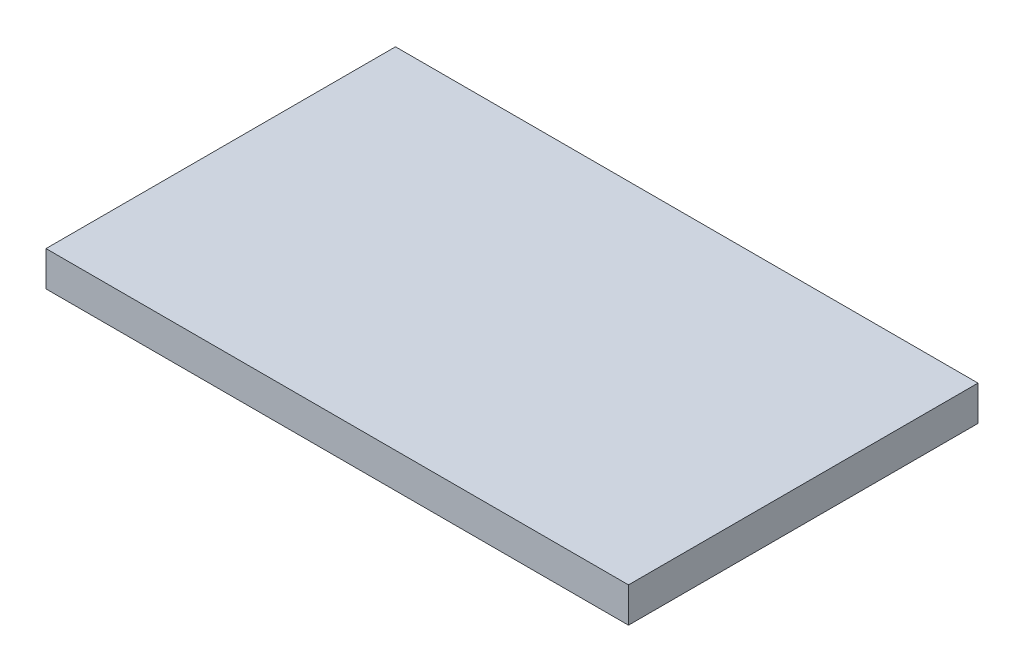
ISO-10303-21;
HEADER;
FILE_DESCRIPTION(('STEP AP214'),'2;1');
FILE_NAME('part.step','',(''),(''),'','','');
FILE_SCHEMA(('AUTOMOTIVE_DESIGN { 1 0 10303 214 1 1 1 1 }'));
ENDSEC;
DATA;
#1=APPLICATION_CONTEXT('core data for automotive mechanical design processes');
#2=APPLICATION_PROTOCOL_DEFINITION('international standard','automotive_design',2000,#1);
#3=PRODUCT_CONTEXT('',#1,'mechanical');
#4=PRODUCT('Part','Part','',(#3));
#5=PRODUCT_RELATED_PRODUCT_CATEGORY('part','',(#4));
#6=PRODUCT_DEFINITION_FORMATION('','',#4);
#7=PRODUCT_DEFINITION_CONTEXT('part definition',#1,'design');
#8=PRODUCT_DEFINITION('design','',#6,#7);
#9=PRODUCT_DEFINITION_SHAPE('','',#8);
#10=(LENGTH_UNIT() NAMED_UNIT(*) SI_UNIT(.MILLI.,.METRE.));
#11=(NAMED_UNIT(*) PLANE_ANGLE_UNIT() SI_UNIT($,.RADIAN.));
#12=(NAMED_UNIT(*) SI_UNIT($,.STERADIAN.) SOLID_ANGLE_UNIT());
#13=UNCERTAINTY_MEASURE_WITH_UNIT(LENGTH_MEASURE(1.E-05),#10,'distance_accuracy_value','');
#14=(GEOMETRIC_REPRESENTATION_CONTEXT(3) GLOBAL_UNCERTAINTY_ASSIGNED_CONTEXT((#13)) GLOBAL_UNIT_ASSIGNED_CONTEXT((#10,
#11,#12)) REPRESENTATION_CONTEXT('',''));
#15=CARTESIAN_POINT('',(0.,0.,0.));
#16=DIRECTION('',(0.,0.,1.));
#17=DIRECTION('',(1.,0.,0.));
#18=AXIS2_PLACEMENT_3D('',#15,#16,#17);
#19=CARTESIAN_POINT('',(0.,1.5,0.));
#20=DIRECTION('',(1.,0.,0.));
#21=DIRECTION('',(0.,0.,-1.));
#22=AXIS2_PLACEMENT_3D('',#19,#20,#21);
#23=PLANE('',#22);
#24=DIRECTION('',(0.,0.,1.));
#25=VECTOR('',#24,1.);
#26=CARTESIAN_POINT('',(0.,0.,0.));
#27=LINE('',#26,#25);
#28=CARTESIAN_POINT('',(0.,0.,-15.));
#29=VERTEX_POINT('',#28);
#30=CARTESIAN_POINT('',(0.,0.,0.));
#31=VERTEX_POINT('',#30);
#32=EDGE_CURVE('E98',#29,#31,#27,.T.);
#33=ORIENTED_EDGE('',*,*,#32,.T.);
#34=DIRECTION('',(0.,-1.,0.));
#35=VECTOR('',#34,1.);
#36=CARTESIAN_POINT('',(0.,1.5,0.));
#37=LINE('',#36,#35);
#38=CARTESIAN_POINT('',(0.,1.5,0.));
#39=VERTEX_POINT('',#38);
#40=EDGE_CURVE('E11',#39,#31,#37,.T.);
#41=ORIENTED_EDGE('',*,*,#40,.F.);
#42=DIRECTION('',(0.,0.,1.));
#43=VECTOR('',#42,1.);
#44=CARTESIAN_POINT('',(0.,1.5,0.));
#45=LINE('',#44,#43);
#46=CARTESIAN_POINT('',(0.,1.5,-15.));
#47=VERTEX_POINT('',#46);
#48=EDGE_CURVE('E86',#47,#39,#45,.T.);
#49=ORIENTED_EDGE('',*,*,#48,.F.);
#50=DIRECTION('',(0.,-1.,0.));
#51=VECTOR('',#50,1.);
#52=CARTESIAN_POINT('',(0.,1.5,-15.));
#53=LINE('',#52,#51);
#54=EDGE_CURVE('E94',#47,#29,#53,.T.);
#55=ORIENTED_EDGE('',*,*,#54,.T.);
#56=EDGE_LOOP('',(#33,#41,#49,#55));
#57=FACE_BOUND('',#56,.T.);
#58=ADVANCED_FACE('F35',(#57),#23,.F.);
#59=CARTESIAN_POINT('',(0.,1.5,0.));
#60=DIRECTION('',(0.,0.,-1.));
#61=DIRECTION('',(-1.,0.,0.));
#62=AXIS2_PLACEMENT_3D('',#59,#60,#61);
#63=PLANE('',#62);
#64=DIRECTION('',(1.,0.,0.));
#65=VECTOR('',#64,1.);
#66=CARTESIAN_POINT('',(0.,0.,0.));
#67=LINE('',#66,#65);
#68=CARTESIAN_POINT('',(25.,0.,0.));
#69=VERTEX_POINT('',#68);
#70=EDGE_CURVE('E90',#31,#69,#67,.T.);
#71=ORIENTED_EDGE('',*,*,#70,.T.);
#72=DIRECTION('',(0.,-1.,0.));
#73=VECTOR('',#72,1.);
#74=CARTESIAN_POINT('',(25.,1.5,0.));
#75=LINE('',#74,#73);
#76=CARTESIAN_POINT('',(25.,1.5,0.));
#77=VERTEX_POINT('',#76);
#78=EDGE_CURVE('E43',#77,#69,#75,.T.);
#79=ORIENTED_EDGE('',*,*,#78,.F.);
#80=DIRECTION('',(1.,0.,0.));
#81=VECTOR('',#80,1.);
#82=CARTESIAN_POINT('',(0.,1.5,0.));
#83=LINE('',#82,#81);
#84=EDGE_CURVE('E81',#39,#77,#83,.T.);
#85=ORIENTED_EDGE('',*,*,#84,.F.);
#86=ORIENTED_EDGE('',*,*,#40,.T.);
#87=EDGE_LOOP('',(#71,#79,#85,#86));
#88=FACE_BOUND('',#87,.T.);
#89=ADVANCED_FACE('F89',(#88),#63,.F.);
#90=CARTESIAN_POINT('',(25.,1.5,0.));
#91=DIRECTION('',(-1.,0.,0.));
#92=DIRECTION('',(0.,0.,1.));
#93=AXIS2_PLACEMENT_3D('',#90,#91,#92);
#94=PLANE('',#93);
#95=DIRECTION('',(0.,0.,-1.));
#96=VECTOR('',#95,1.);
#97=CARTESIAN_POINT('',(25.,0.,0.));
#98=LINE('',#97,#96);
#99=CARTESIAN_POINT('',(25.,0.,-15.));
#100=VERTEX_POINT('',#99);
#101=EDGE_CURVE('E68',#69,#100,#98,.T.);
#102=ORIENTED_EDGE('',*,*,#101,.T.);
#103=DIRECTION('',(0.,-1.,0.));
#104=VECTOR('',#103,1.);
#105=CARTESIAN_POINT('',(25.,1.5,-15.));
#106=LINE('',#105,#104);
#107=CARTESIAN_POINT('',(25.,1.5,-15.));
#108=VERTEX_POINT('',#107);
#109=EDGE_CURVE('E91',#108,#100,#106,.T.);
#110=ORIENTED_EDGE('',*,*,#109,.F.);
#111=DIRECTION('',(0.,0.,-1.));
#112=VECTOR('',#111,1.);
#113=CARTESIAN_POINT('',(25.,1.5,0.));
#114=LINE('',#113,#112);
#115=EDGE_CURVE('E84',#77,#108,#114,.T.);
#116=ORIENTED_EDGE('',*,*,#115,.F.);
#117=ORIENTED_EDGE('',*,*,#78,.T.);
#118=EDGE_LOOP('',(#102,#110,#116,#117));
#119=FACE_BOUND('',#118,.T.);
#120=ADVANCED_FACE('F92',(#119),#94,.F.);
#121=CARTESIAN_POINT('',(0.,1.5,-15.));
#122=DIRECTION('',(0.,0.,1.));
#123=DIRECTION('',(1.,0.,0.));
#124=AXIS2_PLACEMENT_3D('',#121,#122,#123);
#125=PLANE('',#124);
#126=DIRECTION('',(-1.,0.,0.));
#127=VECTOR('',#126,1.);
#128=CARTESIAN_POINT('',(0.,0.,-15.));
#129=LINE('',#128,#127);
#130=EDGE_CURVE('E74',#100,#29,#129,.T.);
#131=ORIENTED_EDGE('',*,*,#130,.T.);
#132=ORIENTED_EDGE('',*,*,#54,.F.);
#133=DIRECTION('',(-1.,0.,0.));
#134=VECTOR('',#133,1.);
#135=CARTESIAN_POINT('',(0.,1.5,-15.));
#136=LINE('',#135,#134);
#137=EDGE_CURVE('E51',#108,#47,#136,.T.);
#138=ORIENTED_EDGE('',*,*,#137,.F.);
#139=ORIENTED_EDGE('',*,*,#109,.T.);
#140=EDGE_LOOP('',(#131,#132,#138,#139));
#141=FACE_BOUND('',#140,.T.);
#142=ADVANCED_FACE('F105',(#141),#125,.F.);
#143=CARTESIAN_POINT('',(0.,1.5,0.));
#144=DIRECTION('',(0.,-1.,0.));
#145=DIRECTION('',(0.,0.,-1.));
#146=AXIS2_PLACEMENT_3D('',#143,#144,#145);
#147=PLANE('',#146);
#148=ORIENTED_EDGE('',*,*,#48,.T.);
#149=ORIENTED_EDGE('',*,*,#84,.T.);
#150=ORIENTED_EDGE('',*,*,#115,.T.);
#151=ORIENTED_EDGE('',*,*,#137,.T.);
#152=EDGE_LOOP('',(#148,#149,#150,#151));
#153=FACE_BOUND('',#152,.T.);
#154=ADVANCED_FACE('F82',(#153),#147,.F.);
#155=CARTESIAN_POINT('',(0.,0.,0.));
#156=DIRECTION('',(0.,-1.,0.));
#157=DIRECTION('',(0.,0.,-1.));
#158=AXIS2_PLACEMENT_3D('',#155,#156,#157);
#159=PLANE('',#158);
#160=ORIENTED_EDGE('',*,*,#32,.F.);
#161=ORIENTED_EDGE('',*,*,#130,.F.);
#162=ORIENTED_EDGE('',*,*,#101,.F.);
#163=ORIENTED_EDGE('',*,*,#70,.F.);
#164=EDGE_LOOP('',(#160,#161,#162,#163));
#165=FACE_BOUND('',#164,.T.);
#166=ADVANCED_FACE('F108',(#165),#159,.T.);
#167=CLOSED_SHELL('',(#58,#89,#120,#142,#154,#166));
#168=MANIFOLD_SOLID_BREP('B2',#167);
#169=ADVANCED_BREP_SHAPE_REPRESENTATION('',(#18,#168),#14);
#170=SHAPE_DEFINITION_REPRESENTATION(#9,#169);
ENDSEC;
END-ISO-10303-21;
